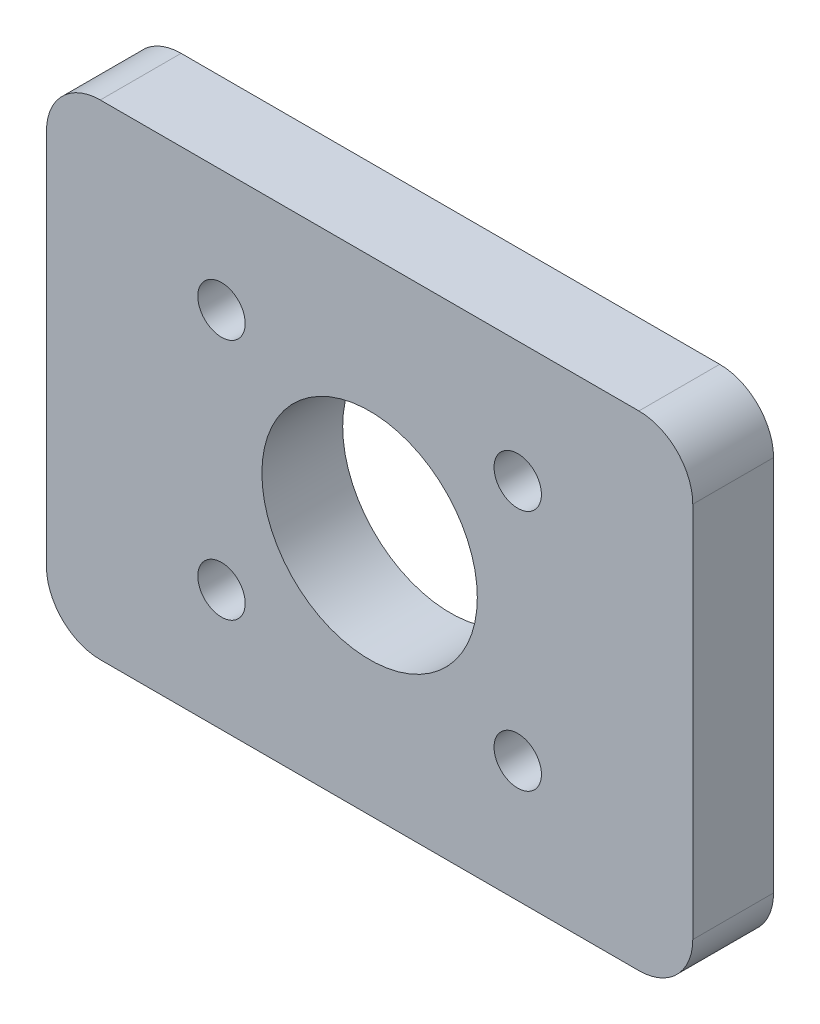
ISO-10303-21;
HEADER;
FILE_DESCRIPTION(('STEP AP214'),'2;1');
FILE_NAME('part.step','',(''),(''),'','','');
FILE_SCHEMA(('AUTOMOTIVE_DESIGN { 1 0 10303 214 1 1 1 1 }'));
ENDSEC;
DATA;
#1=APPLICATION_CONTEXT('core data for automotive mechanical design processes');
#2=APPLICATION_PROTOCOL_DEFINITION('international standard','automotive_design',2000,#1);
#3=PRODUCT_CONTEXT('',#1,'mechanical');
#4=PRODUCT('Part','Part','',(#3));
#5=PRODUCT_RELATED_PRODUCT_CATEGORY('part','',(#4));
#6=PRODUCT_DEFINITION_FORMATION('','',#4);
#7=PRODUCT_DEFINITION_CONTEXT('part definition',#1,'design');
#8=PRODUCT_DEFINITION('design','',#6,#7);
#9=PRODUCT_DEFINITION_SHAPE('','',#8);
#10=(LENGTH_UNIT() NAMED_UNIT(*) SI_UNIT(.MILLI.,.METRE.));
#11=(NAMED_UNIT(*) PLANE_ANGLE_UNIT() SI_UNIT($,.RADIAN.));
#12=(NAMED_UNIT(*) SI_UNIT($,.STERADIAN.) SOLID_ANGLE_UNIT());
#13=UNCERTAINTY_MEASURE_WITH_UNIT(LENGTH_MEASURE(1.E-05),#10,'distance_accuracy_value','');
#14=(GEOMETRIC_REPRESENTATION_CONTEXT(3) GLOBAL_UNCERTAINTY_ASSIGNED_CONTEXT((#13)) GLOBAL_UNIT_ASSIGNED_CONTEXT((#10,
#11,#12)) REPRESENTATION_CONTEXT('',''));
#15=CARTESIAN_POINT('',(0.,0.,0.));
#16=DIRECTION('',(0.,0.,1.));
#17=DIRECTION('',(1.,0.,0.));
#18=AXIS2_PLACEMENT_3D('',#15,#16,#17);
#19=CARTESIAN_POINT('',(-50.,-35.,15.));
#20=DIRECTION('',(0.,0.,1.));
#21=DIRECTION('',(1.,0.,0.));
#22=AXIS2_PLACEMENT_3D('',#19,#20,#21);
#23=PLANE('',#22);
#24=CARTESIAN_POINT('',(27.5,-22.5,15.));
#25=DIRECTION('',(0.,0.,1.));
#26=DIRECTION('',(1.,0.,0.));
#27=AXIS2_PLACEMENT_3D('',#24,#25,#26);
#28=CIRCLE('',#27,4.4);
#29=CARTESIAN_POINT('',(31.9,-22.5,15.));
#30=VERTEX_POINT('',#29);
#31=EDGE_CURVE('E202',#30,#30,#28,.T.);
#32=ORIENTED_EDGE('',*,*,#31,.F.);
#33=EDGE_LOOP('',(#32));
#34=FACE_BOUND('',#33,.T.);
#35=CARTESIAN_POINT('',(27.5,22.5,15.));
#36=DIRECTION('',(0.,0.,1.));
#37=DIRECTION('',(1.,0.,0.));
#38=AXIS2_PLACEMENT_3D('',#35,#36,#37);
#39=CIRCLE('',#38,4.4);
#40=CARTESIAN_POINT('',(31.9,22.5,15.));
#41=VERTEX_POINT('',#40);
#42=EDGE_CURVE('E190',#41,#41,#39,.T.);
#43=ORIENTED_EDGE('',*,*,#42,.F.);
#44=EDGE_LOOP('',(#43));
#45=FACE_BOUND('',#44,.T.);
#46=CARTESIAN_POINT('',(-50.,-35.,15.));
#47=DIRECTION('',(0.,0.,1.));
#48=DIRECTION('',(1.,0.,0.));
#49=AXIS2_PLACEMENT_3D('',#46,#47,#48);
#50=CIRCLE('',#49,9.99999999999999);
#51=CARTESIAN_POINT('',(-60.,-34.9999999999999,15.));
#52=VERTEX_POINT('',#51);
#53=CARTESIAN_POINT('',(-49.9999999999999,-45.,15.));
#54=VERTEX_POINT('',#53);
#55=EDGE_CURVE('E153',#52,#54,#50,.T.);
#56=ORIENTED_EDGE('',*,*,#55,.T.);
#57=DIRECTION('',(1.,0.,0.));
#58=VECTOR('',#57,1.);
#59=CARTESIAN_POINT('',(-49.9999999999999,-45.,15.));
#60=LINE('',#59,#58);
#61=CARTESIAN_POINT('',(49.9999999999999,-45.,15.));
#62=VERTEX_POINT('',#61);
#63=EDGE_CURVE('E101',#54,#62,#60,.T.);
#64=ORIENTED_EDGE('',*,*,#63,.T.);
#65=CARTESIAN_POINT('',(50.,-35.,15.));
#66=DIRECTION('',(0.,0.,1.));
#67=DIRECTION('',(1.,0.,0.));
#68=AXIS2_PLACEMENT_3D('',#65,#66,#67);
#69=CIRCLE('',#68,10.);
#70=CARTESIAN_POINT('',(60.,-34.9999999999999,15.));
#71=VERTEX_POINT('',#70);
#72=EDGE_CURVE('E168',#62,#71,#69,.T.);
#73=ORIENTED_EDGE('',*,*,#72,.T.);
#74=DIRECTION('',(0.,1.,0.));
#75=VECTOR('',#74,1.);
#76=CARTESIAN_POINT('',(60.,34.9999999999999,15.));
#77=LINE('',#76,#75);
#78=CARTESIAN_POINT('',(60.,34.9999999999999,15.));
#79=VERTEX_POINT('',#78);
#80=EDGE_CURVE('E181',#71,#79,#77,.T.);
#81=ORIENTED_EDGE('',*,*,#80,.T.);
#82=CARTESIAN_POINT('',(50.,35.,15.));
#83=DIRECTION('',(0.,0.,1.));
#84=DIRECTION('',(1.,0.,0.));
#85=AXIS2_PLACEMENT_3D('',#82,#83,#84);
#86=CIRCLE('',#85,10.);
#87=CARTESIAN_POINT('',(49.9999999999999,45.,15.));
#88=VERTEX_POINT('',#87);
#89=EDGE_CURVE('E120',#79,#88,#86,.T.);
#90=ORIENTED_EDGE('',*,*,#89,.T.);
#91=DIRECTION('',(-1.,0.,0.));
#92=VECTOR('',#91,1.);
#93=CARTESIAN_POINT('',(-49.9999999999999,45.,15.));
#94=LINE('',#93,#92);
#95=CARTESIAN_POINT('',(-49.9999999999999,45.,15.));
#96=VERTEX_POINT('',#95);
#97=EDGE_CURVE('E114',#88,#96,#94,.T.);
#98=ORIENTED_EDGE('',*,*,#97,.T.);
#99=CARTESIAN_POINT('',(-50.,35.,15.));
#100=DIRECTION('',(0.,0.,1.));
#101=DIRECTION('',(1.,0.,0.));
#102=AXIS2_PLACEMENT_3D('',#99,#100,#101);
#103=CIRCLE('',#102,10.);
#104=CARTESIAN_POINT('',(-60.,34.9999999999999,15.));
#105=VERTEX_POINT('',#104);
#106=EDGE_CURVE('E118',#96,#105,#103,.T.);
#107=ORIENTED_EDGE('',*,*,#106,.T.);
#108=DIRECTION('',(0.,-1.,0.));
#109=VECTOR('',#108,1.);
#110=CARTESIAN_POINT('',(-60.,34.9999999999999,15.));
#111=LINE('',#110,#109);
#112=EDGE_CURVE('E58',#105,#52,#111,.T.);
#113=ORIENTED_EDGE('',*,*,#112,.T.);
#114=EDGE_LOOP('',(#56,#64,#73,#81,#90,#98,#107,#113));
#115=FACE_BOUND('',#114,.T.);
#116=CARTESIAN_POINT('',(-27.5,22.5,15.));
#117=DIRECTION('',(0.,0.,1.));
#118=DIRECTION('',(1.,0.,0.));
#119=AXIS2_PLACEMENT_3D('',#116,#117,#118);
#120=CIRCLE('',#119,4.4);
#121=CARTESIAN_POINT('',(-23.1,22.5,15.));
#122=VERTEX_POINT('',#121);
#123=EDGE_CURVE('E142',#122,#122,#120,.T.);
#124=ORIENTED_EDGE('',*,*,#123,.F.);
#125=EDGE_LOOP('',(#124));
#126=FACE_BOUND('',#125,.T.);
#127=CARTESIAN_POINT('',(-27.5,-22.5,15.));
#128=DIRECTION('',(0.,0.,1.));
#129=DIRECTION('',(1.,0.,0.));
#130=AXIS2_PLACEMENT_3D('',#127,#128,#129);
#131=CIRCLE('',#130,4.4);
#132=CARTESIAN_POINT('',(-23.1,-22.5,15.));
#133=VERTEX_POINT('',#132);
#134=EDGE_CURVE('E196',#133,#133,#131,.T.);
#135=ORIENTED_EDGE('',*,*,#134,.F.);
#136=EDGE_LOOP('',(#135));
#137=FACE_BOUND('',#136,.T.);
#138=CARTESIAN_POINT('',(0.,0.,15.));
#139=DIRECTION('',(0.,0.,1.));
#140=DIRECTION('',(1.,0.,0.));
#141=AXIS2_PLACEMENT_3D('',#138,#139,#140);
#142=CIRCLE('',#141,20.);
#143=CARTESIAN_POINT('',(20.,0.,15.));
#144=VERTEX_POINT('',#143);
#145=EDGE_CURVE('E208',#144,#144,#142,.T.);
#146=ORIENTED_EDGE('',*,*,#145,.F.);
#147=EDGE_LOOP('',(#146));
#148=FACE_BOUND('',#147,.T.);
#149=ADVANCED_FACE('F41',(#34,#45,#115,#126,#137,#148),#23,.T.);
#150=CARTESIAN_POINT('',(-50.,-35.,0.));
#151=DIRECTION('',(0.,0.,1.));
#152=DIRECTION('',(1.,0.,0.));
#153=AXIS2_PLACEMENT_3D('',#150,#151,#152);
#154=PLANE('',#153);
#155=CARTESIAN_POINT('',(-50.,-35.,0.));
#156=DIRECTION('',(0.,0.,1.));
#157=DIRECTION('',(1.,0.,0.));
#158=AXIS2_PLACEMENT_3D('',#155,#156,#157);
#159=CIRCLE('',#158,9.99999999999999);
#160=CARTESIAN_POINT('',(-60.,-34.9999999999999,0.));
#161=VERTEX_POINT('',#160);
#162=CARTESIAN_POINT('',(-49.9999999999999,-45.,0.));
#163=VERTEX_POINT('',#162);
#164=EDGE_CURVE('E138',#161,#163,#159,.T.);
#165=ORIENTED_EDGE('',*,*,#164,.F.);
#166=DIRECTION('',(0.,-1.,0.));
#167=VECTOR('',#166,1.);
#168=CARTESIAN_POINT('',(-60.,34.9999999999999,0.));
#169=LINE('',#168,#167);
#170=CARTESIAN_POINT('',(-60.,34.9999999999999,0.));
#171=VERTEX_POINT('',#170);
#172=EDGE_CURVE('E93',#171,#161,#169,.T.);
#173=ORIENTED_EDGE('',*,*,#172,.F.);
#174=CARTESIAN_POINT('',(-50.,35.,0.));
#175=DIRECTION('',(0.,0.,1.));
#176=DIRECTION('',(1.,0.,0.));
#177=AXIS2_PLACEMENT_3D('',#174,#175,#176);
#178=CIRCLE('',#177,10.);
#179=CARTESIAN_POINT('',(-49.9999999999999,45.,0.));
#180=VERTEX_POINT('',#179);
#181=EDGE_CURVE('E87',#180,#171,#178,.T.);
#182=ORIENTED_EDGE('',*,*,#181,.F.);
#183=DIRECTION('',(-1.,0.,0.));
#184=VECTOR('',#183,1.);
#185=CARTESIAN_POINT('',(-49.9999999999999,45.,0.));
#186=LINE('',#185,#184);
#187=CARTESIAN_POINT('',(49.9999999999999,45.,0.));
#188=VERTEX_POINT('',#187);
#189=EDGE_CURVE('E128',#188,#180,#186,.T.);
#190=ORIENTED_EDGE('',*,*,#189,.F.);
#191=CARTESIAN_POINT('',(50.,35.,0.));
#192=DIRECTION('',(0.,0.,1.));
#193=DIRECTION('',(1.,0.,0.));
#194=AXIS2_PLACEMENT_3D('',#191,#192,#193);
#195=CIRCLE('',#194,10.);
#196=CARTESIAN_POINT('',(60.,34.9999999999999,0.));
#197=VERTEX_POINT('',#196);
#198=EDGE_CURVE('E148',#197,#188,#195,.T.);
#199=ORIENTED_EDGE('',*,*,#198,.F.);
#200=DIRECTION('',(0.,1.,0.));
#201=VECTOR('',#200,1.);
#202=CARTESIAN_POINT('',(60.,34.9999999999999,0.));
#203=LINE('',#202,#201);
#204=CARTESIAN_POINT('',(60.,-34.9999999999999,0.));
#205=VERTEX_POINT('',#204);
#206=EDGE_CURVE('E146',#205,#197,#203,.T.);
#207=ORIENTED_EDGE('',*,*,#206,.F.);
#208=CARTESIAN_POINT('',(50.,-35.,0.));
#209=DIRECTION('',(0.,0.,1.));
#210=DIRECTION('',(1.,0.,0.));
#211=AXIS2_PLACEMENT_3D('',#208,#209,#210);
#212=CIRCLE('',#211,10.);
#213=CARTESIAN_POINT('',(49.9999999999999,-45.,0.));
#214=VERTEX_POINT('',#213);
#215=EDGE_CURVE('E144',#214,#205,#212,.T.);
#216=ORIENTED_EDGE('',*,*,#215,.F.);
#217=DIRECTION('',(1.,0.,0.));
#218=VECTOR('',#217,1.);
#219=CARTESIAN_POINT('',(-49.9999999999999,-45.,0.));
#220=LINE('',#219,#218);
#221=EDGE_CURVE('E141',#163,#214,#220,.T.);
#222=ORIENTED_EDGE('',*,*,#221,.F.);
#223=EDGE_LOOP('',(#165,#173,#182,#190,#199,#207,#216,#222));
#224=FACE_BOUND('',#223,.T.);
#225=CARTESIAN_POINT('',(-27.5,22.5,0.));
#226=DIRECTION('',(0.,0.,1.));
#227=DIRECTION('',(1.,0.,0.));
#228=AXIS2_PLACEMENT_3D('',#225,#226,#227);
#229=CIRCLE('',#228,4.4);
#230=CARTESIAN_POINT('',(-23.1,22.5,0.));
#231=VERTEX_POINT('',#230);
#232=EDGE_CURVE('E187',#231,#231,#229,.T.);
#233=ORIENTED_EDGE('',*,*,#232,.T.);
#234=EDGE_LOOP('',(#233));
#235=FACE_BOUND('',#234,.T.);
#236=CARTESIAN_POINT('',(27.5,22.5,0.));
#237=DIRECTION('',(0.,0.,1.));
#238=DIRECTION('',(1.,0.,0.));
#239=AXIS2_PLACEMENT_3D('',#236,#237,#238);
#240=CIRCLE('',#239,4.4);
#241=CARTESIAN_POINT('',(31.9,22.5,0.));
#242=VERTEX_POINT('',#241);
#243=EDGE_CURVE('E193',#242,#242,#240,.T.);
#244=ORIENTED_EDGE('',*,*,#243,.T.);
#245=EDGE_LOOP('',(#244));
#246=FACE_BOUND('',#245,.T.);
#247=CARTESIAN_POINT('',(-27.5,-22.5,0.));
#248=DIRECTION('',(0.,0.,1.));
#249=DIRECTION('',(1.,0.,0.));
#250=AXIS2_PLACEMENT_3D('',#247,#248,#249);
#251=CIRCLE('',#250,4.4);
#252=CARTESIAN_POINT('',(-23.1,-22.5,0.));
#253=VERTEX_POINT('',#252);
#254=EDGE_CURVE('E199',#253,#253,#251,.T.);
#255=ORIENTED_EDGE('',*,*,#254,.T.);
#256=EDGE_LOOP('',(#255));
#257=FACE_BOUND('',#256,.T.);
#258=CARTESIAN_POINT('',(27.5,-22.5,0.));
#259=DIRECTION('',(0.,0.,1.));
#260=DIRECTION('',(1.,0.,0.));
#261=AXIS2_PLACEMENT_3D('',#258,#259,#260);
#262=CIRCLE('',#261,4.4);
#263=CARTESIAN_POINT('',(31.9,-22.5,0.));
#264=VERTEX_POINT('',#263);
#265=EDGE_CURVE('E205',#264,#264,#262,.T.);
#266=ORIENTED_EDGE('',*,*,#265,.T.);
#267=EDGE_LOOP('',(#266));
#268=FACE_BOUND('',#267,.T.);
#269=CARTESIAN_POINT('',(0.,0.,0.));
#270=DIRECTION('',(0.,0.,1.));
#271=DIRECTION('',(1.,0.,0.));
#272=AXIS2_PLACEMENT_3D('',#269,#270,#271);
#273=CIRCLE('',#272,20.);
#274=CARTESIAN_POINT('',(20.,0.,0.));
#275=VERTEX_POINT('',#274);
#276=EDGE_CURVE('E211',#275,#275,#273,.T.);
#277=ORIENTED_EDGE('',*,*,#276,.T.);
#278=EDGE_LOOP('',(#277));
#279=FACE_BOUND('',#278,.T.);
#280=ADVANCED_FACE('F172',(#224,#235,#246,#257,#268,#279),#154,.F.);
#281=CARTESIAN_POINT('',(-50.,-35.,15.));
#282=DIRECTION('',(0.,0.,-1.));
#283=DIRECTION('',(-1.,0.,0.));
#284=AXIS2_PLACEMENT_3D('',#281,#282,#283);
#285=CYLINDRICAL_SURFACE('',#284,9.99999999999999);
#286=ORIENTED_EDGE('',*,*,#164,.T.);
#287=DIRECTION('',(0.,0.,-1.));
#288=VECTOR('',#287,1.);
#289=CARTESIAN_POINT('',(-49.9999999999999,-45.,15.));
#290=LINE('',#289,#288);
#291=EDGE_CURVE('E11',#54,#163,#290,.T.);
#292=ORIENTED_EDGE('',*,*,#291,.F.);
#293=ORIENTED_EDGE('',*,*,#55,.F.);
#294=DIRECTION('',(0.,0.,-1.));
#295=VECTOR('',#294,1.);
#296=CARTESIAN_POINT('',(-60.,-34.9999999999999,15.));
#297=LINE('',#296,#295);
#298=EDGE_CURVE('E134',#52,#161,#297,.T.);
#299=ORIENTED_EDGE('',*,*,#298,.T.);
#300=EDGE_LOOP('',(#286,#292,#293,#299));
#301=FACE_BOUND('',#300,.T.);
#302=ADVANCED_FACE('F43',(#301),#285,.T.);
#303=CARTESIAN_POINT('',(-49.9999999999999,-45.,15.));
#304=DIRECTION('',(0.,1.,0.));
#305=DIRECTION('',(0.,0.,1.));
#306=AXIS2_PLACEMENT_3D('',#303,#304,#305);
#307=PLANE('',#306);
#308=ORIENTED_EDGE('',*,*,#221,.T.);
#309=DIRECTION('',(0.,0.,-1.));
#310=VECTOR('',#309,1.);
#311=CARTESIAN_POINT('',(49.9999999999999,-45.,15.));
#312=LINE('',#311,#310);
#313=EDGE_CURVE('E50',#62,#214,#312,.T.);
#314=ORIENTED_EDGE('',*,*,#313,.F.);
#315=ORIENTED_EDGE('',*,*,#63,.F.);
#316=ORIENTED_EDGE('',*,*,#291,.T.);
#317=EDGE_LOOP('',(#308,#314,#315,#316));
#318=FACE_BOUND('',#317,.T.);
#319=ADVANCED_FACE('F245',(#318),#307,.F.);
#320=CARTESIAN_POINT('',(50.,-35.,15.));
#321=DIRECTION('',(0.,0.,-1.));
#322=DIRECTION('',(-1.,0.,0.));
#323=AXIS2_PLACEMENT_3D('',#320,#321,#322);
#324=CYLINDRICAL_SURFACE('',#323,10.);
#325=ORIENTED_EDGE('',*,*,#215,.T.);
#326=DIRECTION('',(0.,0.,-1.));
#327=VECTOR('',#326,1.);
#328=CARTESIAN_POINT('',(60.,-34.9999999999999,15.));
#329=LINE('',#328,#327);
#330=EDGE_CURVE('E160',#71,#205,#329,.T.);
#331=ORIENTED_EDGE('',*,*,#330,.F.);
#332=ORIENTED_EDGE('',*,*,#72,.F.);
#333=ORIENTED_EDGE('',*,*,#313,.T.);
#334=EDGE_LOOP('',(#325,#331,#332,#333));
#335=FACE_BOUND('',#334,.T.);
#336=ADVANCED_FACE('F166',(#335),#324,.T.);
#337=CARTESIAN_POINT('',(60.,34.9999999999999,15.));
#338=DIRECTION('',(-1.,0.,0.));
#339=DIRECTION('',(0.,-1.,0.));
#340=AXIS2_PLACEMENT_3D('',#337,#338,#339);
#341=PLANE('',#340);
#342=ORIENTED_EDGE('',*,*,#206,.T.);
#343=DIRECTION('',(0.,0.,-1.));
#344=VECTOR('',#343,1.);
#345=CARTESIAN_POINT('',(60.,34.9999999999999,15.));
#346=LINE('',#345,#344);
#347=EDGE_CURVE('E157',#79,#197,#346,.T.);
#348=ORIENTED_EDGE('',*,*,#347,.F.);
#349=ORIENTED_EDGE('',*,*,#80,.F.);
#350=ORIENTED_EDGE('',*,*,#330,.T.);
#351=EDGE_LOOP('',(#342,#348,#349,#350));
#352=FACE_BOUND('',#351,.T.);
#353=ADVANCED_FACE('F177',(#352),#341,.F.);
#354=CARTESIAN_POINT('',(50.,35.,15.));
#355=DIRECTION('',(0.,0.,-1.));
#356=DIRECTION('',(-1.,0.,0.));
#357=AXIS2_PLACEMENT_3D('',#354,#355,#356);
#358=CYLINDRICAL_SURFACE('',#357,10.);
#359=ORIENTED_EDGE('',*,*,#198,.T.);
#360=DIRECTION('',(0.,0.,-1.));
#361=VECTOR('',#360,1.);
#362=CARTESIAN_POINT('',(49.9999999999999,45.,15.));
#363=LINE('',#362,#361);
#364=EDGE_CURVE('E129',#88,#188,#363,.T.);
#365=ORIENTED_EDGE('',*,*,#364,.F.);
#366=ORIENTED_EDGE('',*,*,#89,.F.);
#367=ORIENTED_EDGE('',*,*,#347,.T.);
#368=EDGE_LOOP('',(#359,#365,#366,#367));
#369=FACE_BOUND('',#368,.T.);
#370=ADVANCED_FACE('F180',(#369),#358,.T.);
#371=CARTESIAN_POINT('',(-49.9999999999999,45.,15.));
#372=DIRECTION('',(0.,-1.,0.));
#373=DIRECTION('',(0.,0.,-1.));
#374=AXIS2_PLACEMENT_3D('',#371,#372,#373);
#375=PLANE('',#374);
#376=ORIENTED_EDGE('',*,*,#189,.T.);
#377=DIRECTION('',(0.,0.,-1.));
#378=VECTOR('',#377,1.);
#379=CARTESIAN_POINT('',(-49.9999999999999,45.,15.));
#380=LINE('',#379,#378);
#381=EDGE_CURVE('E125',#96,#180,#380,.T.);
#382=ORIENTED_EDGE('',*,*,#381,.F.);
#383=ORIENTED_EDGE('',*,*,#97,.F.);
#384=ORIENTED_EDGE('',*,*,#364,.T.);
#385=EDGE_LOOP('',(#376,#382,#383,#384));
#386=FACE_BOUND('',#385,.T.);
#387=ADVANCED_FACE('F126',(#386),#375,.F.);
#388=CARTESIAN_POINT('',(-50.,35.,15.));
#389=DIRECTION('',(0.,0.,-1.));
#390=DIRECTION('',(-1.,0.,0.));
#391=AXIS2_PLACEMENT_3D('',#388,#389,#390);
#392=CYLINDRICAL_SURFACE('',#391,10.);
#393=ORIENTED_EDGE('',*,*,#181,.T.);
#394=DIRECTION('',(0.,0.,-1.));
#395=VECTOR('',#394,1.);
#396=CARTESIAN_POINT('',(-60.,34.9999999999999,15.));
#397=LINE('',#396,#395);
#398=EDGE_CURVE('E130',#105,#171,#397,.T.);
#399=ORIENTED_EDGE('',*,*,#398,.F.);
#400=ORIENTED_EDGE('',*,*,#106,.F.);
#401=ORIENTED_EDGE('',*,*,#381,.T.);
#402=EDGE_LOOP('',(#393,#399,#400,#401));
#403=FACE_BOUND('',#402,.T.);
#404=ADVANCED_FACE('F132',(#403),#392,.T.);
#405=CARTESIAN_POINT('',(-60.,34.9999999999999,15.));
#406=DIRECTION('',(1.,0.,0.));
#407=DIRECTION('',(0.,1.,0.));
#408=AXIS2_PLACEMENT_3D('',#405,#406,#407);
#409=PLANE('',#408);
#410=ORIENTED_EDGE('',*,*,#172,.T.);
#411=ORIENTED_EDGE('',*,*,#298,.F.);
#412=ORIENTED_EDGE('',*,*,#112,.F.);
#413=ORIENTED_EDGE('',*,*,#398,.T.);
#414=EDGE_LOOP('',(#410,#411,#412,#413));
#415=FACE_BOUND('',#414,.T.);
#416=ADVANCED_FACE('F233',(#415),#409,.F.);
#417=CARTESIAN_POINT('',(-27.5,22.5,15.));
#418=DIRECTION('',(0.,0.,-1.));
#419=DIRECTION('',(-1.,0.,0.));
#420=AXIS2_PLACEMENT_3D('',#417,#418,#419);
#421=CYLINDRICAL_SURFACE('',#420,4.4);
#422=ORIENTED_EDGE('',*,*,#123,.T.);
#423=EDGE_LOOP('',(#422));
#424=FACE_BOUND('',#423,.T.);
#425=ORIENTED_EDGE('',*,*,#232,.F.);
#426=EDGE_LOOP('',(#425));
#427=FACE_BOUND('',#426,.T.);
#428=ADVANCED_FACE('F230',(#424,#427),#421,.F.);
#429=CARTESIAN_POINT('',(27.5,22.5,15.));
#430=DIRECTION('',(0.,0.,-1.));
#431=DIRECTION('',(-1.,0.,0.));
#432=AXIS2_PLACEMENT_3D('',#429,#430,#431);
#433=CYLINDRICAL_SURFACE('',#432,4.4);
#434=ORIENTED_EDGE('',*,*,#42,.T.);
#435=EDGE_LOOP('',(#434));
#436=FACE_BOUND('',#435,.T.);
#437=ORIENTED_EDGE('',*,*,#243,.F.);
#438=EDGE_LOOP('',(#437));
#439=FACE_BOUND('',#438,.T.);
#440=ADVANCED_FACE('F308',(#436,#439),#433,.F.);
#441=CARTESIAN_POINT('',(-27.5,-22.5,15.));
#442=DIRECTION('',(0.,0.,-1.));
#443=DIRECTION('',(-1.,0.,0.));
#444=AXIS2_PLACEMENT_3D('',#441,#442,#443);
#445=CYLINDRICAL_SURFACE('',#444,4.4);
#446=ORIENTED_EDGE('',*,*,#134,.T.);
#447=EDGE_LOOP('',(#446));
#448=FACE_BOUND('',#447,.T.);
#449=ORIENTED_EDGE('',*,*,#254,.F.);
#450=EDGE_LOOP('',(#449));
#451=FACE_BOUND('',#450,.T.);
#452=ADVANCED_FACE('F316',(#448,#451),#445,.F.);
#453=CARTESIAN_POINT('',(27.5,-22.5,15.));
#454=DIRECTION('',(0.,0.,-1.));
#455=DIRECTION('',(-1.,0.,0.));
#456=AXIS2_PLACEMENT_3D('',#453,#454,#455);
#457=CYLINDRICAL_SURFACE('',#456,4.4);
#458=ORIENTED_EDGE('',*,*,#31,.T.);
#459=EDGE_LOOP('',(#458));
#460=FACE_BOUND('',#459,.T.);
#461=ORIENTED_EDGE('',*,*,#265,.F.);
#462=EDGE_LOOP('',(#461));
#463=FACE_BOUND('',#462,.T.);
#464=ADVANCED_FACE('F324',(#460,#463),#457,.F.);
#465=CARTESIAN_POINT('',(0.,0.,15.));
#466=DIRECTION('',(0.,0.,-1.));
#467=DIRECTION('',(-1.,0.,0.));
#468=AXIS2_PLACEMENT_3D('',#465,#466,#467);
#469=CYLINDRICAL_SURFACE('',#468,20.);
#470=ORIENTED_EDGE('',*,*,#145,.T.);
#471=EDGE_LOOP('',(#470));
#472=FACE_BOUND('',#471,.T.);
#473=ORIENTED_EDGE('',*,*,#276,.F.);
#474=EDGE_LOOP('',(#473));
#475=FACE_BOUND('',#474,.T.);
#476=ADVANCED_FACE('F217',(#472,#475),#469,.F.);
#477=CLOSED_SHELL('',(#149,#280,#302,#319,#336,#353,#370,#387,#404,#416,#428,#440,#452,#464,#476));
#478=MANIFOLD_SOLID_BREP('B2',#477);
#479=ADVANCED_BREP_SHAPE_REPRESENTATION('',(#18,#478),#14);
#480=SHAPE_DEFINITION_REPRESENTATION(#9,#479);
ENDSEC;
END-ISO-10303-21;
